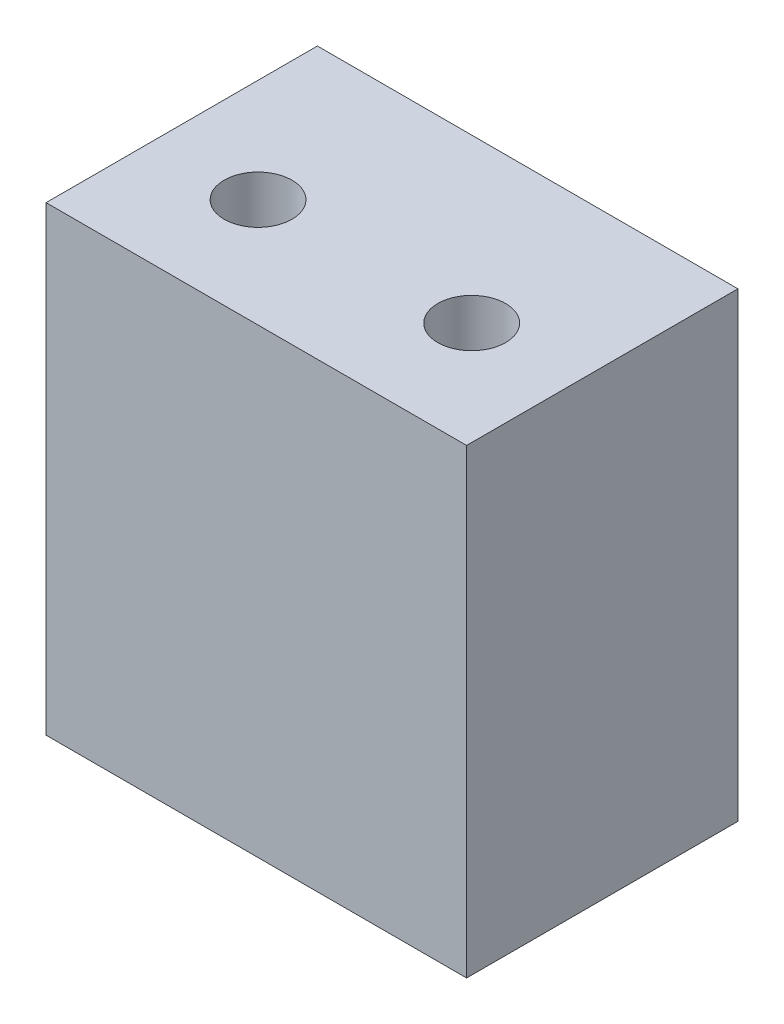
ISO-10303-21;
HEADER;
FILE_DESCRIPTION(('STEP AP214'),'2;1');
FILE_NAME('part.step','',(''),(''),'','','');
FILE_SCHEMA(('AUTOMOTIVE_DESIGN { 1 0 10303 214 1 1 1 1 }'));
ENDSEC;
DATA;
#1=APPLICATION_CONTEXT('core data for automotive mechanical design processes');
#2=APPLICATION_PROTOCOL_DEFINITION('international standard','automotive_design',2000,#1);
#3=PRODUCT_CONTEXT('',#1,'mechanical');
#4=PRODUCT('Part','Part','',(#3));
#5=PRODUCT_RELATED_PRODUCT_CATEGORY('part','',(#4));
#6=PRODUCT_DEFINITION_FORMATION('','',#4);
#7=PRODUCT_DEFINITION_CONTEXT('part definition',#1,'design');
#8=PRODUCT_DEFINITION('design','',#6,#7);
#9=PRODUCT_DEFINITION_SHAPE('','',#8);
#10=(LENGTH_UNIT() NAMED_UNIT(*) SI_UNIT(.MILLI.,.METRE.));
#11=(NAMED_UNIT(*) PLANE_ANGLE_UNIT() SI_UNIT($,.RADIAN.));
#12=(NAMED_UNIT(*) SI_UNIT($,.STERADIAN.) SOLID_ANGLE_UNIT());
#13=UNCERTAINTY_MEASURE_WITH_UNIT(LENGTH_MEASURE(1.E-05),#10,'distance_accuracy_value','');
#14=(GEOMETRIC_REPRESENTATION_CONTEXT(3) GLOBAL_UNCERTAINTY_ASSIGNED_CONTEXT((#13)) GLOBAL_UNIT_ASSIGNED_CONTEXT((#10,
#11,#12)) REPRESENTATION_CONTEXT('',''));
#15=CARTESIAN_POINT('',(0.,0.,0.));
#16=DIRECTION('',(0.,0.,1.));
#17=DIRECTION('',(1.,0.,0.));
#18=AXIS2_PLACEMENT_3D('',#15,#16,#17);
#19=CARTESIAN_POINT('',(-9.8425,-10.795,12.7));
#20=DIRECTION('',(1.,0.,0.));
#21=DIRECTION('',(0.,0.,-1.));
#22=AXIS2_PLACEMENT_3D('',#19,#20,#21);
#23=PLANE('',#22);
#24=DIRECTION('',(0.,-1.,0.));
#25=VECTOR('',#24,1.);
#26=CARTESIAN_POINT('',(-9.8425,-10.795,0.));
#27=LINE('',#26,#25);
#28=CARTESIAN_POINT('',(-9.8425,10.795,0.));
#29=VERTEX_POINT('',#28);
#30=CARTESIAN_POINT('',(-9.8425,-10.795,0.));
#31=VERTEX_POINT('',#30);
#32=EDGE_CURVE('E96',#29,#31,#27,.T.);
#33=ORIENTED_EDGE('',*,*,#32,.T.);
#34=DIRECTION('',(0.,0.,-1.));
#35=VECTOR('',#34,1.);
#36=CARTESIAN_POINT('',(-9.8425,-10.795,12.7));
#37=LINE('',#36,#35);
#38=CARTESIAN_POINT('',(-9.8425,-10.795,12.7));
#39=VERTEX_POINT('',#38);
#40=EDGE_CURVE('E11',#39,#31,#37,.T.);
#41=ORIENTED_EDGE('',*,*,#40,.F.);
#42=DIRECTION('',(0.,-1.,0.));
#43=VECTOR('',#42,1.);
#44=CARTESIAN_POINT('',(-9.8425,-10.795,12.7));
#45=LINE('',#44,#43);
#46=CARTESIAN_POINT('',(-9.8425,10.795,12.7));
#47=VERTEX_POINT('',#46);
#48=EDGE_CURVE('E84',#47,#39,#45,.T.);
#49=ORIENTED_EDGE('',*,*,#48,.F.);
#50=DIRECTION('',(0.,0.,-1.));
#51=VECTOR('',#50,1.);
#52=CARTESIAN_POINT('',(-9.8425,10.795,12.7));
#53=LINE('',#52,#51);
#54=EDGE_CURVE('E92',#47,#29,#53,.T.);
#55=ORIENTED_EDGE('',*,*,#54,.T.);
#56=EDGE_LOOP('',(#33,#41,#49,#55));
#57=FACE_BOUND('',#56,.T.);
#58=ADVANCED_FACE('F33',(#57),#23,.F.);
#59=CARTESIAN_POINT('',(9.8425,-10.795,12.7));
#60=DIRECTION('',(0.,1.,0.));
#61=DIRECTION('',(-1.,0.,0.));
#62=AXIS2_PLACEMENT_3D('',#59,#60,#61);
#63=PLANE('',#62);
#64=DIRECTION('',(1.,0.,0.));
#65=VECTOR('',#64,1.);
#66=CARTESIAN_POINT('',(9.8425,-10.795,0.));
#67=LINE('',#66,#65);
#68=CARTESIAN_POINT('',(9.8425,-10.795,0.));
#69=VERTEX_POINT('',#68);
#70=EDGE_CURVE('E88',#31,#69,#67,.T.);
#71=ORIENTED_EDGE('',*,*,#70,.T.);
#72=DIRECTION('',(0.,0.,-1.));
#73=VECTOR('',#72,1.);
#74=CARTESIAN_POINT('',(9.8425,-10.795,12.7));
#75=LINE('',#74,#73);
#76=CARTESIAN_POINT('',(9.8425,-10.795,12.7));
#77=VERTEX_POINT('',#76);
#78=EDGE_CURVE('E41',#77,#69,#75,.T.);
#79=ORIENTED_EDGE('',*,*,#78,.F.);
#80=DIRECTION('',(1.,0.,0.));
#81=VECTOR('',#80,1.);
#82=CARTESIAN_POINT('',(9.8425,-10.795,12.7));
#83=LINE('',#82,#81);
#84=EDGE_CURVE('E79',#39,#77,#83,.T.);
#85=ORIENTED_EDGE('',*,*,#84,.F.);
#86=ORIENTED_EDGE('',*,*,#40,.T.);
#87=EDGE_LOOP('',(#71,#79,#85,#86));
#88=FACE_BOUND('',#87,.T.);
#89=ADVANCED_FACE('F87',(#88),#63,.F.);
#90=CARTESIAN_POINT('',(9.8425,-10.795,12.7));
#91=DIRECTION('',(-1.,0.,0.));
#92=DIRECTION('',(0.,0.,1.));
#93=AXIS2_PLACEMENT_3D('',#90,#91,#92);
#94=PLANE('',#93);
#95=DIRECTION('',(0.,1.,0.));
#96=VECTOR('',#95,1.);
#97=CARTESIAN_POINT('',(9.8425,-10.795,0.));
#98=LINE('',#97,#96);
#99=CARTESIAN_POINT('',(9.8425,10.795,0.));
#100=VERTEX_POINT('',#99);
#101=EDGE_CURVE('E66',#69,#100,#98,.T.);
#102=ORIENTED_EDGE('',*,*,#101,.T.);
#103=DIRECTION('',(0.,0.,-1.));
#104=VECTOR('',#103,1.);
#105=CARTESIAN_POINT('',(9.8425,10.795,12.7));
#106=LINE('',#105,#104);
#107=CARTESIAN_POINT('',(9.8425,10.795,12.7));
#108=VERTEX_POINT('',#107);
#109=EDGE_CURVE('E89',#108,#100,#106,.T.);
#110=ORIENTED_EDGE('',*,*,#109,.F.);
#111=DIRECTION('',(0.,1.,0.));
#112=VECTOR('',#111,1.);
#113=CARTESIAN_POINT('',(9.8425,-10.795,12.7));
#114=LINE('',#113,#112);
#115=EDGE_CURVE('E82',#77,#108,#114,.T.);
#116=ORIENTED_EDGE('',*,*,#115,.F.);
#117=ORIENTED_EDGE('',*,*,#78,.T.);
#118=EDGE_LOOP('',(#102,#110,#116,#117));
#119=FACE_BOUND('',#118,.T.);
#120=ADVANCED_FACE('F90',(#119),#94,.F.);
#121=CARTESIAN_POINT('',(9.8425,10.795,12.7));
#122=DIRECTION('',(0.,-1.,0.));
#123=DIRECTION('',(1.,0.,0.));
#124=AXIS2_PLACEMENT_3D('',#121,#122,#123);
#125=PLANE('',#124);
#126=CARTESIAN_POINT('',(-5.,10.795,7.62));
#127=DIRECTION('',(0.,1.,0.));
#128=DIRECTION('',(1.,0.,0.));
#129=AXIS2_PLACEMENT_3D('',#126,#127,#128);
#130=CIRCLE('',#129,1.5875);
#131=CARTESIAN_POINT('',(-3.4125,10.795,7.62));
#132=VERTEX_POINT('',#131);
#133=EDGE_CURVE('E116',#132,#132,#130,.T.);
#134=ORIENTED_EDGE('',*,*,#133,.F.);
#135=EDGE_LOOP('',(#134));
#136=FACE_BOUND('',#135,.T.);
#137=CARTESIAN_POINT('',(5.,10.795,7.62));
#138=DIRECTION('',(0.,1.,0.));
#139=DIRECTION('',(-1.,0.,0.));
#140=AXIS2_PLACEMENT_3D('',#137,#138,#139);
#141=CIRCLE('',#140,1.5875);
#142=CARTESIAN_POINT('',(3.4125,10.795,7.62));
#143=VERTEX_POINT('',#142);
#144=EDGE_CURVE('E110',#143,#143,#141,.T.);
#145=ORIENTED_EDGE('',*,*,#144,.F.);
#146=EDGE_LOOP('',(#145));
#147=FACE_BOUND('',#146,.T.);
#148=DIRECTION('',(-1.,0.,0.));
#149=VECTOR('',#148,1.);
#150=CARTESIAN_POINT('',(9.8425,10.795,0.));
#151=LINE('',#150,#149);
#152=EDGE_CURVE('E72',#100,#29,#151,.T.);
#153=ORIENTED_EDGE('',*,*,#152,.T.);
#154=ORIENTED_EDGE('',*,*,#54,.F.);
#155=DIRECTION('',(-1.,0.,0.));
#156=VECTOR('',#155,1.);
#157=CARTESIAN_POINT('',(9.8425,10.795,12.7));
#158=LINE('',#157,#156);
#159=EDGE_CURVE('E49',#108,#47,#158,.T.);
#160=ORIENTED_EDGE('',*,*,#159,.F.);
#161=ORIENTED_EDGE('',*,*,#109,.T.);
#162=EDGE_LOOP('',(#153,#154,#160,#161));
#163=FACE_BOUND('',#162,.T.);
#164=ADVANCED_FACE('F104',(#136,#147,#163),#125,.F.);
#165=CARTESIAN_POINT('',(0.,0.,12.7));
#166=DIRECTION('',(0.,0.,1.));
#167=DIRECTION('',(1.,0.,0.));
#168=AXIS2_PLACEMENT_3D('',#165,#166,#167);
#169=PLANE('',#168);
#170=ORIENTED_EDGE('',*,*,#48,.T.);
#171=ORIENTED_EDGE('',*,*,#84,.T.);
#172=ORIENTED_EDGE('',*,*,#115,.T.);
#173=ORIENTED_EDGE('',*,*,#159,.T.);
#174=EDGE_LOOP('',(#170,#171,#172,#173));
#175=FACE_BOUND('',#174,.T.);
#176=ADVANCED_FACE('F80',(#175),#169,.T.);
#177=CARTESIAN_POINT('',(0.,0.,0.));
#178=DIRECTION('',(0.,0.,1.));
#179=DIRECTION('',(1.,0.,0.));
#180=AXIS2_PLACEMENT_3D('',#177,#178,#179);
#181=PLANE('',#180);
#182=ORIENTED_EDGE('',*,*,#32,.F.);
#183=ORIENTED_EDGE('',*,*,#152,.F.);
#184=ORIENTED_EDGE('',*,*,#101,.F.);
#185=ORIENTED_EDGE('',*,*,#70,.F.);
#186=EDGE_LOOP('',(#182,#183,#184,#185));
#187=FACE_BOUND('',#186,.T.);
#188=ADVANCED_FACE('F107',(#187),#181,.F.);
#189=CARTESIAN_POINT('',(5.,4.445,7.62));
#190=DIRECTION('',(0.,1.,0.));
#191=DIRECTION('',(-1.,0.,0.));
#192=AXIS2_PLACEMENT_3D('',#189,#190,#191);
#193=CYLINDRICAL_SURFACE('',#192,1.5875);
#194=CARTESIAN_POINT('',(5.,4.445,7.62));
#195=DIRECTION('',(0.,1.,0.));
#196=DIRECTION('',(-1.,0.,0.));
#197=AXIS2_PLACEMENT_3D('',#194,#195,#196);
#198=CIRCLE('',#197,1.5875);
#199=CARTESIAN_POINT('',(3.4125,4.445,7.62));
#200=VERTEX_POINT('',#199);
#201=EDGE_CURVE('E99',#200,#200,#198,.T.);
#202=ORIENTED_EDGE('',*,*,#201,.F.);
#203=EDGE_LOOP('',(#202));
#204=FACE_BOUND('',#203,.T.);
#205=ORIENTED_EDGE('',*,*,#144,.T.);
#206=EDGE_LOOP('',(#205));
#207=FACE_BOUND('',#206,.T.);
#208=ADVANCED_FACE('F136',(#204,#207),#193,.F.);
#209=CARTESIAN_POINT('',(5.,4.445,7.62));
#210=DIRECTION('',(0.,1.,0.));
#211=DIRECTION('',(-1.,0.,0.));
#212=AXIS2_PLACEMENT_3D('',#209,#210,#211);
#213=PLANE('',#212);
#214=ORIENTED_EDGE('',*,*,#201,.T.);
#215=EDGE_LOOP('',(#214));
#216=FACE_BOUND('',#215,.T.);
#217=ADVANCED_FACE('F127',(#216),#213,.T.);
#218=CARTESIAN_POINT('',(-5.,4.445,7.62));
#219=DIRECTION('',(0.,1.,0.));
#220=DIRECTION('',(-1.,0.,0.));
#221=AXIS2_PLACEMENT_3D('',#218,#219,#220);
#222=CYLINDRICAL_SURFACE('',#221,1.5875);
#223=CARTESIAN_POINT('',(-5.,4.445,7.62));
#224=DIRECTION('',(0.,1.,0.));
#225=DIRECTION('',(1.,0.,0.));
#226=AXIS2_PLACEMENT_3D('',#223,#224,#225);
#227=CIRCLE('',#226,1.5875);
#228=CARTESIAN_POINT('',(-3.4125,4.445,7.62));
#229=VERTEX_POINT('',#228);
#230=EDGE_CURVE('E113',#229,#229,#227,.T.);
#231=ORIENTED_EDGE('',*,*,#230,.F.);
#232=EDGE_LOOP('',(#231));
#233=FACE_BOUND('',#232,.T.);
#234=ORIENTED_EDGE('',*,*,#133,.T.);
#235=EDGE_LOOP('',(#234));
#236=FACE_BOUND('',#235,.T.);
#237=ADVANCED_FACE('F124',(#233,#236),#222,.F.);
#238=CARTESIAN_POINT('',(-5.,4.445,7.62));
#239=DIRECTION('',(0.,-1.,0.));
#240=DIRECTION('',(1.,0.,0.));
#241=AXIS2_PLACEMENT_3D('',#238,#239,#240);
#242=PLANE('',#241);
#243=ORIENTED_EDGE('',*,*,#230,.T.);
#244=EDGE_LOOP('',(#243));
#245=FACE_BOUND('',#244,.T.);
#246=ADVANCED_FACE('F122',(#245),#242,.F.);
#247=CLOSED_SHELL('',(#58,#89,#120,#164,#176,#188,#208,#217,#237,#246));
#248=MANIFOLD_SOLID_BREP('B2',#247);
#249=ADVANCED_BREP_SHAPE_REPRESENTATION('',(#18,#248),#14);
#250=SHAPE_DEFINITION_REPRESENTATION(#9,#249);
ENDSEC;
END-ISO-10303-21;
